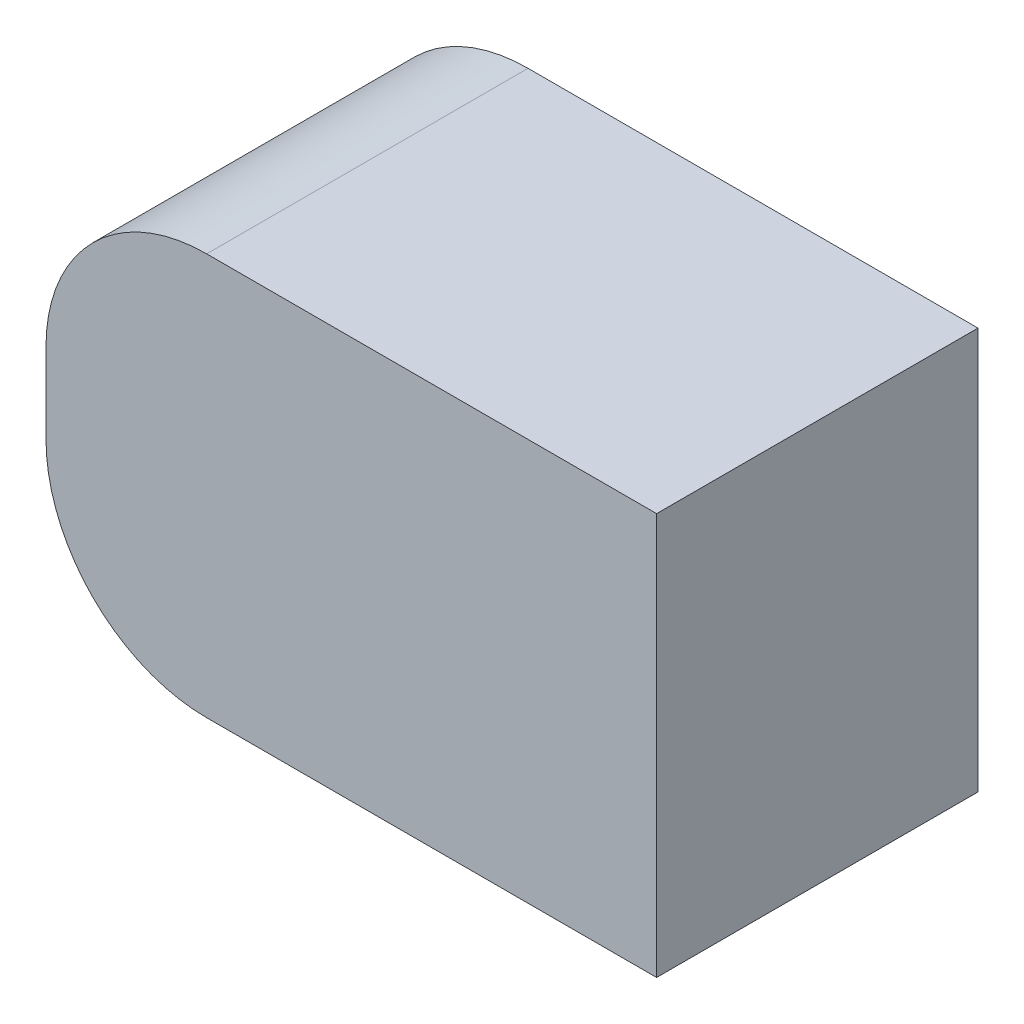
ISO-10303-21;
HEADER;
FILE_DESCRIPTION(('STEP AP214'),'2;1');
FILE_NAME('part.step','',(''),(''),'','','');
FILE_SCHEMA(('AUTOMOTIVE_DESIGN { 1 0 10303 214 1 1 1 1 }'));
ENDSEC;
DATA;
#1=APPLICATION_CONTEXT('core data for automotive mechanical design processes');
#2=APPLICATION_PROTOCOL_DEFINITION('international standard','automotive_design',2000,#1);
#3=PRODUCT_CONTEXT('',#1,'mechanical');
#4=PRODUCT('Part','Part','',(#3));
#5=PRODUCT_RELATED_PRODUCT_CATEGORY('part','',(#4));
#6=PRODUCT_DEFINITION_FORMATION('','',#4);
#7=PRODUCT_DEFINITION_CONTEXT('part definition',#1,'design');
#8=PRODUCT_DEFINITION('design','',#6,#7);
#9=PRODUCT_DEFINITION_SHAPE('','',#8);
#10=(LENGTH_UNIT() NAMED_UNIT(*) SI_UNIT(.MILLI.,.METRE.));
#11=(NAMED_UNIT(*) PLANE_ANGLE_UNIT() SI_UNIT($,.RADIAN.));
#12=(NAMED_UNIT(*) SI_UNIT($,.STERADIAN.) SOLID_ANGLE_UNIT());
#13=UNCERTAINTY_MEASURE_WITH_UNIT(LENGTH_MEASURE(1.E-05),#10,'distance_accuracy_value','');
#14=(GEOMETRIC_REPRESENTATION_CONTEXT(3) GLOBAL_UNCERTAINTY_ASSIGNED_CONTEXT((#13)) GLOBAL_UNIT_ASSIGNED_CONTEXT((#10,
#11,#12)) REPRESENTATION_CONTEXT('',''));
#15=CARTESIAN_POINT('',(0.,0.,0.));
#16=DIRECTION('',(0.,0.,1.));
#17=DIRECTION('',(1.,0.,0.));
#18=AXIS2_PLACEMENT_3D('',#15,#16,#17);
#19=CARTESIAN_POINT('',(1.223,-0.475,0.));
#20=DIRECTION('',(0.,0.,-1.));
#21=DIRECTION('',(-0.707106781186548,0.707106781186547,0.));
#22=AXIS2_PLACEMENT_3D('',#19,#20,#21);
#23=CYLINDRICAL_SURFACE('',#22,0.1);
#24=CARTESIAN_POINT('',(1.223,-0.475,0.2));
#25=DIRECTION('',(0.,0.,1.));
#26=DIRECTION('',(-0.707106781186548,0.707106781186547,0.));
#27=AXIS2_PLACEMENT_3D('',#24,#25,#26);
#28=CIRCLE('',#27,0.1);
#29=CARTESIAN_POINT('',(1.223,-0.375000000000001,0.2));
#30=VERTEX_POINT('',#29);
#31=CARTESIAN_POINT('',(1.123,-0.475,0.2));
#32=VERTEX_POINT('',#31);
#33=EDGE_CURVE('E11',#30,#32,#28,.T.);
#34=ORIENTED_EDGE('',*,*,#33,.F.);
#35=DIRECTION('',(0.,0.,1.));
#36=VECTOR('',#35,1.);
#37=CARTESIAN_POINT('',(1.223,-0.375000000000001,0.));
#38=LINE('',#37,#36);
#39=CARTESIAN_POINT('',(1.223,-0.375000000000001,0.));
#40=VERTEX_POINT('',#39);
#41=EDGE_CURVE('E24',#40,#30,#38,.T.);
#42=ORIENTED_EDGE('',*,*,#41,.F.);
#43=CARTESIAN_POINT('',(1.223,-0.475,0.));
#44=DIRECTION('',(0.,0.,-1.));
#45=DIRECTION('',(-0.707106781186548,0.707106781186547,0.));
#46=AXIS2_PLACEMENT_3D('',#43,#44,#45);
#47=CIRCLE('',#46,0.1);
#48=CARTESIAN_POINT('',(1.123,-0.475,0.));
#49=VERTEX_POINT('',#48);
#50=EDGE_CURVE('E114',#49,#40,#47,.T.);
#51=ORIENTED_EDGE('',*,*,#50,.F.);
#52=DIRECTION('',(0.,0.,-1.));
#53=VECTOR('',#52,1.);
#54=CARTESIAN_POINT('',(1.123,-0.475,0.));
#55=LINE('',#54,#53);
#56=EDGE_CURVE('E111',#32,#49,#55,.T.);
#57=ORIENTED_EDGE('',*,*,#56,.F.);
#58=EDGE_LOOP('',(#34,#42,#51,#57));
#59=FACE_BOUND('',#58,.T.);
#60=ADVANCED_FACE('F17',(#59),#23,.T.);
#61=CARTESIAN_POINT('',(1.313,-0.5,0.));
#62=DIRECTION('',(0.,0.,-1.));
#63=DIRECTION('',(-1.,0.,0.));
#64=AXIS2_PLACEMENT_3D('',#61,#62,#63);
#65=PLANE('',#64);
#66=ORIENTED_EDGE('',*,*,#50,.T.);
#67=DIRECTION('',(1.,0.,0.));
#68=VECTOR('',#67,1.);
#69=CARTESIAN_POINT('',(1.123,-0.375000000000001,0.));
#70=LINE('',#69,#68);
#71=CARTESIAN_POINT('',(1.503,-0.375000000000001,0.));
#72=VERTEX_POINT('',#71);
#73=EDGE_CURVE('E109',#40,#72,#70,.T.);
#74=ORIENTED_EDGE('',*,*,#73,.T.);
#75=DIRECTION('',(0.,-1.,0.));
#76=VECTOR('',#75,1.);
#77=CARTESIAN_POINT('',(1.503,-0.375000000000001,0.));
#78=LINE('',#77,#76);
#79=CARTESIAN_POINT('',(1.503,-0.625000000000001,0.));
#80=VERTEX_POINT('',#79);
#81=EDGE_CURVE('E107',#72,#80,#78,.T.);
#82=ORIENTED_EDGE('',*,*,#81,.T.);
#83=DIRECTION('',(-1.,0.,0.));
#84=VECTOR('',#83,1.);
#85=CARTESIAN_POINT('',(1.503,-0.625000000000001,0.));
#86=LINE('',#85,#84);
#87=CARTESIAN_POINT('',(1.223,-0.624999999999986,0.));
#88=VERTEX_POINT('',#87);
#89=EDGE_CURVE('E72',#80,#88,#86,.T.);
#90=ORIENTED_EDGE('',*,*,#89,.T.);
#91=CARTESIAN_POINT('',(1.223,-0.524999999999986,0.));
#92=DIRECTION('',(0.,0.,-1.));
#93=DIRECTION('',(-0.707106781186565,-0.70710678118653,0.));
#94=AXIS2_PLACEMENT_3D('',#91,#92,#93);
#95=CIRCLE('',#94,0.1);
#96=CARTESIAN_POINT('',(1.123,-0.524999999999986,0.));
#97=VERTEX_POINT('',#96);
#98=EDGE_CURVE('E104',#88,#97,#95,.T.);
#99=ORIENTED_EDGE('',*,*,#98,.T.);
#100=DIRECTION('',(0.,1.,0.));
#101=VECTOR('',#100,1.);
#102=CARTESIAN_POINT('',(1.123,-0.625000000000001,0.));
#103=LINE('',#102,#101);
#104=EDGE_CURVE('E101',#97,#49,#103,.T.);
#105=ORIENTED_EDGE('',*,*,#104,.T.);
#106=EDGE_LOOP('',(#66,#74,#82,#90,#99,#105));
#107=FACE_BOUND('',#106,.T.);
#108=ADVANCED_FACE('F120',(#107),#65,.T.);
#109=CARTESIAN_POINT('',(1.123,-0.625000000000001,0.));
#110=DIRECTION('',(1.,0.,0.));
#111=DIRECTION('',(0.,1.,0.));
#112=AXIS2_PLACEMENT_3D('',#109,#110,#111);
#113=PLANE('',#112);
#114=ORIENTED_EDGE('',*,*,#56,.T.);
#115=ORIENTED_EDGE('',*,*,#104,.F.);
#116=DIRECTION('',(0.,0.,1.));
#117=VECTOR('',#116,1.);
#118=CARTESIAN_POINT('',(1.123,-0.524999999999986,0.));
#119=LINE('',#118,#117);
#120=CARTESIAN_POINT('',(1.123,-0.524999999999986,0.2));
#121=VERTEX_POINT('',#120);
#122=EDGE_CURVE('E99',#97,#121,#119,.T.);
#123=ORIENTED_EDGE('',*,*,#122,.T.);
#124=DIRECTION('',(0.,1.,0.));
#125=VECTOR('',#124,1.);
#126=CARTESIAN_POINT('',(1.123,-0.625000000000001,0.2));
#127=LINE('',#126,#125);
#128=EDGE_CURVE('E96',#121,#32,#127,.T.);
#129=ORIENTED_EDGE('',*,*,#128,.T.);
#130=EDGE_LOOP('',(#114,#115,#123,#129));
#131=FACE_BOUND('',#130,.T.);
#132=ADVANCED_FACE('F125',(#131),#113,.F.);
#133=CARTESIAN_POINT('',(1.223,-0.524999999999986,0.));
#134=DIRECTION('',(0.,0.,-1.));
#135=DIRECTION('',(-0.707106781186565,-0.70710678118653,0.));
#136=AXIS2_PLACEMENT_3D('',#133,#134,#135);
#137=CYLINDRICAL_SURFACE('',#136,0.1);
#138=CARTESIAN_POINT('',(1.223,-0.524999999999986,0.2));
#139=DIRECTION('',(0.,0.,1.));
#140=DIRECTION('',(-0.707106781186565,-0.70710678118653,0.));
#141=AXIS2_PLACEMENT_3D('',#138,#139,#140);
#142=CIRCLE('',#141,0.1);
#143=CARTESIAN_POINT('',(1.223,-0.624999999999986,0.2));
#144=VERTEX_POINT('',#143);
#145=EDGE_CURVE('E82',#121,#144,#142,.T.);
#146=ORIENTED_EDGE('',*,*,#145,.F.);
#147=ORIENTED_EDGE('',*,*,#122,.F.);
#148=ORIENTED_EDGE('',*,*,#98,.F.);
#149=DIRECTION('',(0.,0.,-1.));
#150=VECTOR('',#149,1.);
#151=CARTESIAN_POINT('',(1.223,-0.624999999999986,0.));
#152=LINE('',#151,#150);
#153=EDGE_CURVE('E93',#144,#88,#152,.T.);
#154=ORIENTED_EDGE('',*,*,#153,.F.);
#155=EDGE_LOOP('',(#146,#147,#148,#154));
#156=FACE_BOUND('',#155,.T.);
#157=ADVANCED_FACE('F127',(#156),#137,.T.);
#158=CARTESIAN_POINT('',(1.123,-0.375000000000001,0.));
#159=DIRECTION('',(0.,-1.,0.));
#160=DIRECTION('',(1.,0.,0.));
#161=AXIS2_PLACEMENT_3D('',#158,#159,#160);
#162=PLANE('',#161);
#163=ORIENTED_EDGE('',*,*,#41,.T.);
#164=DIRECTION('',(1.,0.,0.));
#165=VECTOR('',#164,1.);
#166=CARTESIAN_POINT('',(1.123,-0.375000000000001,0.2));
#167=LINE('',#166,#165);
#168=CARTESIAN_POINT('',(1.503,-0.375000000000001,0.2));
#169=VERTEX_POINT('',#168);
#170=EDGE_CURVE('E91',#30,#169,#167,.T.);
#171=ORIENTED_EDGE('',*,*,#170,.T.);
#172=DIRECTION('',(0.,0.,1.));
#173=VECTOR('',#172,1.);
#174=CARTESIAN_POINT('',(1.503,-0.375000000000001,0.));
#175=LINE('',#174,#173);
#176=EDGE_CURVE('E76',#72,#169,#175,.T.);
#177=ORIENTED_EDGE('',*,*,#176,.F.);
#178=ORIENTED_EDGE('',*,*,#73,.F.);
#179=EDGE_LOOP('',(#163,#171,#177,#178));
#180=FACE_BOUND('',#179,.T.);
#181=ADVANCED_FACE('F118',(#180),#162,.F.);
#182=CARTESIAN_POINT('',(1.503,-0.625000000000001,0.));
#183=DIRECTION('',(0.,1.,0.));
#184=DIRECTION('',(-1.,0.,0.));
#185=AXIS2_PLACEMENT_3D('',#182,#183,#184);
#186=PLANE('',#185);
#187=ORIENTED_EDGE('',*,*,#153,.T.);
#188=ORIENTED_EDGE('',*,*,#89,.F.);
#189=DIRECTION('',(0.,0.,1.));
#190=VECTOR('',#189,1.);
#191=CARTESIAN_POINT('',(1.503,-0.625000000000001,0.));
#192=LINE('',#191,#190);
#193=CARTESIAN_POINT('',(1.503,-0.625000000000001,0.2));
#194=VERTEX_POINT('',#193);
#195=EDGE_CURVE('E67',#80,#194,#192,.T.);
#196=ORIENTED_EDGE('',*,*,#195,.T.);
#197=DIRECTION('',(-1.,0.,0.));
#198=VECTOR('',#197,1.);
#199=CARTESIAN_POINT('',(1.503,-0.625000000000001,0.2));
#200=LINE('',#199,#198);
#201=EDGE_CURVE('E71',#194,#144,#200,.T.);
#202=ORIENTED_EDGE('',*,*,#201,.T.);
#203=EDGE_LOOP('',(#187,#188,#196,#202));
#204=FACE_BOUND('',#203,.T.);
#205=ADVANCED_FACE('F70',(#204),#186,.F.);
#206=CARTESIAN_POINT('',(1.503,-0.375000000000001,0.));
#207=DIRECTION('',(-1.,0.,0.));
#208=DIRECTION('',(0.,-1.,0.));
#209=AXIS2_PLACEMENT_3D('',#206,#207,#208);
#210=PLANE('',#209);
#211=ORIENTED_EDGE('',*,*,#81,.F.);
#212=ORIENTED_EDGE('',*,*,#176,.T.);
#213=DIRECTION('',(0.,-1.,0.));
#214=VECTOR('',#213,1.);
#215=CARTESIAN_POINT('',(1.503,-0.375000000000001,0.2));
#216=LINE('',#215,#214);
#217=EDGE_CURVE('E80',#169,#194,#216,.T.);
#218=ORIENTED_EDGE('',*,*,#217,.T.);
#219=ORIENTED_EDGE('',*,*,#195,.F.);
#220=EDGE_LOOP('',(#211,#212,#218,#219));
#221=FACE_BOUND('',#220,.T.);
#222=ADVANCED_FACE('F86',(#221),#210,.F.);
#223=CARTESIAN_POINT('',(1.313,-0.5,0.2));
#224=DIRECTION('',(0.,0.,-1.));
#225=DIRECTION('',(-1.,0.,0.));
#226=AXIS2_PLACEMENT_3D('',#223,#224,#225);
#227=PLANE('',#226);
#228=ORIENTED_EDGE('',*,*,#33,.T.);
#229=ORIENTED_EDGE('',*,*,#128,.F.);
#230=ORIENTED_EDGE('',*,*,#145,.T.);
#231=ORIENTED_EDGE('',*,*,#201,.F.);
#232=ORIENTED_EDGE('',*,*,#217,.F.);
#233=ORIENTED_EDGE('',*,*,#170,.F.);
#234=EDGE_LOOP('',(#228,#229,#230,#231,#232,#233));
#235=FACE_BOUND('',#234,.T.);
#236=ADVANCED_FACE('F79',(#235),#227,.F.);
#237=CLOSED_SHELL('',(#60,#108,#132,#157,#181,#205,#222,#236));
#238=MANIFOLD_SOLID_BREP('B1',#237);
#239=ADVANCED_BREP_SHAPE_REPRESENTATION('',(#18,#238),#14);
#240=SHAPE_DEFINITION_REPRESENTATION(#9,#239);
ENDSEC;
END-ISO-10303-21;
